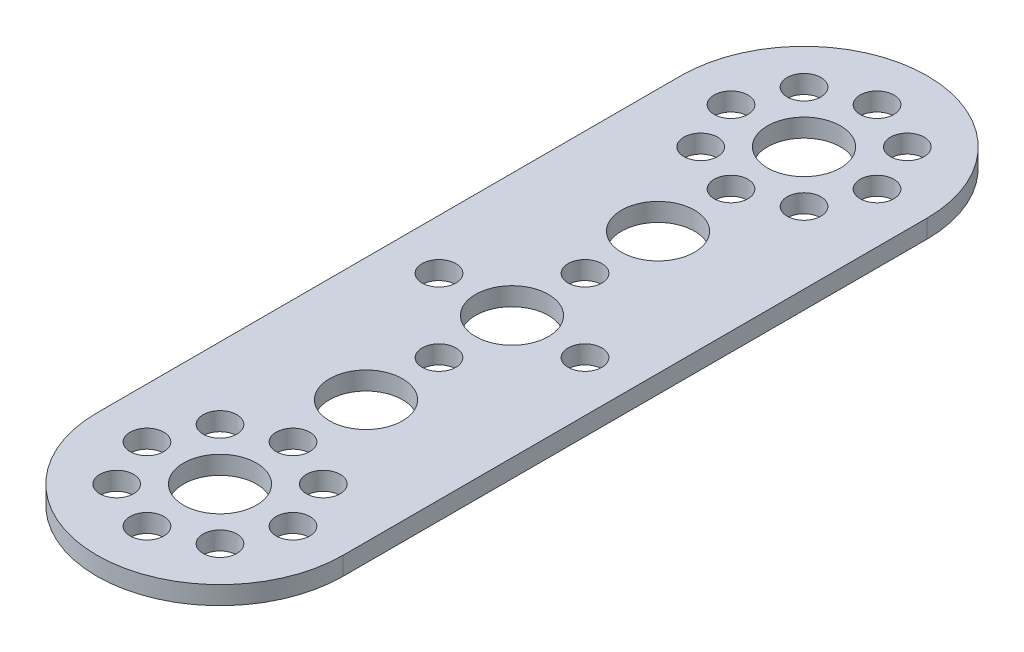
ISO-10303-21;
HEADER;
FILE_DESCRIPTION(('STEP AP214'),'2;1');
FILE_NAME('part.step','',(''),(''),'','','');
FILE_SCHEMA(('AUTOMOTIVE_DESIGN { 1 0 10303 214 1 1 1 1 }'));
ENDSEC;
DATA;
#1=APPLICATION_CONTEXT('core data for automotive mechanical design processes');
#2=APPLICATION_PROTOCOL_DEFINITION('international standard','automotive_design',2000,#1);
#3=PRODUCT_CONTEXT('',#1,'mechanical');
#4=PRODUCT('Part','Part','',(#3));
#5=PRODUCT_RELATED_PRODUCT_CATEGORY('part','',(#4));
#6=PRODUCT_DEFINITION_FORMATION('','',#4);
#7=PRODUCT_DEFINITION_CONTEXT('part definition',#1,'design');
#8=PRODUCT_DEFINITION('design','',#6,#7);
#9=PRODUCT_DEFINITION_SHAPE('','',#8);
#10=(LENGTH_UNIT() NAMED_UNIT(*) SI_UNIT(.MILLI.,.METRE.));
#11=(NAMED_UNIT(*) PLANE_ANGLE_UNIT() SI_UNIT($,.RADIAN.));
#12=(NAMED_UNIT(*) SI_UNIT($,.STERADIAN.) SOLID_ANGLE_UNIT());
#13=UNCERTAINTY_MEASURE_WITH_UNIT(LENGTH_MEASURE(1.E-05),#10,'distance_accuracy_value','');
#14=(GEOMETRIC_REPRESENTATION_CONTEXT(3) GLOBAL_UNCERTAINTY_ASSIGNED_CONTEXT((#13)) GLOBAL_UNIT_ASSIGNED_CONTEXT((#10,
#11,#12)) REPRESENTATION_CONTEXT('',''));
#15=CARTESIAN_POINT('',(0.,0.,0.));
#16=DIRECTION('',(0.,0.,1.));
#17=DIRECTION('',(1.,0.,0.));
#18=AXIS2_PLACEMENT_3D('',#15,#16,#17);
#19=CARTESIAN_POINT('',(0.,2.,-32.));
#20=DIRECTION('',(0.,-1.,0.));
#21=DIRECTION('',(0.,0.,-1.));
#22=AXIS2_PLACEMENT_3D('',#19,#20,#21);
#23=CYLINDRICAL_SURFACE('',#22,13.5);
#24=CARTESIAN_POINT('',(0.,0.,-32.));
#25=DIRECTION('',(0.,1.,0.));
#26=DIRECTION('',(0.,0.,1.));
#27=AXIS2_PLACEMENT_3D('',#24,#25,#26);
#28=CIRCLE('',#27,13.5);
#29=CARTESIAN_POINT('',(13.5,0.,-32.));
#30=VERTEX_POINT('',#29);
#31=CARTESIAN_POINT('',(-13.5,0.,-32.));
#32=VERTEX_POINT('',#31);
#33=EDGE_CURVE('E95',#30,#32,#28,.T.);
#34=ORIENTED_EDGE('',*,*,#33,.T.);
#35=DIRECTION('',(0.,-1.,0.));
#36=VECTOR('',#35,1.);
#37=CARTESIAN_POINT('',(-13.5,2.,-32.));
#38=LINE('',#37,#36);
#39=CARTESIAN_POINT('',(-13.5,2.,-32.));
#40=VERTEX_POINT('',#39);
#41=EDGE_CURVE('E11',#40,#32,#38,.T.);
#42=ORIENTED_EDGE('',*,*,#41,.F.);
#43=CARTESIAN_POINT('',(0.,2.,-32.));
#44=DIRECTION('',(0.,1.,0.));
#45=DIRECTION('',(0.,0.,1.));
#46=AXIS2_PLACEMENT_3D('',#43,#44,#45);
#47=CIRCLE('',#46,13.5);
#48=CARTESIAN_POINT('',(13.5,2.,-32.));
#49=VERTEX_POINT('',#48);
#50=EDGE_CURVE('E83',#49,#40,#47,.T.);
#51=ORIENTED_EDGE('',*,*,#50,.F.);
#52=DIRECTION('',(0.,-1.,0.));
#53=VECTOR('',#52,1.);
#54=CARTESIAN_POINT('',(13.5,2.,-32.));
#55=LINE('',#54,#53);
#56=EDGE_CURVE('E91',#49,#30,#55,.T.);
#57=ORIENTED_EDGE('',*,*,#56,.T.);
#58=EDGE_LOOP('',(#34,#42,#51,#57));
#59=FACE_BOUND('',#58,.T.);
#60=ADVANCED_FACE('F32',(#59),#23,.T.);
#61=CARTESIAN_POINT('',(-13.5,2.,32.));
#62=DIRECTION('',(1.,0.,0.));
#63=DIRECTION('',(0.,0.,-1.));
#64=AXIS2_PLACEMENT_3D('',#61,#62,#63);
#65=PLANE('',#64);
#66=DIRECTION('',(0.,0.,1.));
#67=VECTOR('',#66,1.);
#68=CARTESIAN_POINT('',(-13.5,0.,32.));
#69=LINE('',#68,#67);
#70=CARTESIAN_POINT('',(-13.5,0.,32.));
#71=VERTEX_POINT('',#70);
#72=EDGE_CURVE('E87',#32,#71,#69,.T.);
#73=ORIENTED_EDGE('',*,*,#72,.T.);
#74=DIRECTION('',(0.,-1.,0.));
#75=VECTOR('',#74,1.);
#76=CARTESIAN_POINT('',(-13.5,2.,32.));
#77=LINE('',#76,#75);
#78=CARTESIAN_POINT('',(-13.5,2.,32.));
#79=VERTEX_POINT('',#78);
#80=EDGE_CURVE('E40',#79,#71,#77,.T.);
#81=ORIENTED_EDGE('',*,*,#80,.F.);
#82=DIRECTION('',(0.,0.,1.));
#83=VECTOR('',#82,1.);
#84=CARTESIAN_POINT('',(-13.5,2.,32.));
#85=LINE('',#84,#83);
#86=EDGE_CURVE('E78',#40,#79,#85,.T.);
#87=ORIENTED_EDGE('',*,*,#86,.F.);
#88=ORIENTED_EDGE('',*,*,#41,.T.);
#89=EDGE_LOOP('',(#73,#81,#87,#88));
#90=FACE_BOUND('',#89,.T.);
#91=ADVANCED_FACE('F86',(#90),#65,.F.);
#92=CARTESIAN_POINT('',(0.,2.,32.));
#93=DIRECTION('',(0.,-1.,0.));
#94=DIRECTION('',(0.,0.,-1.));
#95=AXIS2_PLACEMENT_3D('',#92,#93,#94);
#96=CYLINDRICAL_SURFACE('',#95,13.5);
#97=CARTESIAN_POINT('',(0.,0.,32.));
#98=DIRECTION('',(0.,1.,0.));
#99=DIRECTION('',(0.,0.,1.));
#100=AXIS2_PLACEMENT_3D('',#97,#98,#99);
#101=CIRCLE('',#100,13.5);
#102=CARTESIAN_POINT('',(13.5,0.,32.));
#103=VERTEX_POINT('',#102);
#104=EDGE_CURVE('E65',#71,#103,#101,.T.);
#105=ORIENTED_EDGE('',*,*,#104,.T.);
#106=DIRECTION('',(0.,-1.,0.));
#107=VECTOR('',#106,1.);
#108=CARTESIAN_POINT('',(13.5,2.,32.));
#109=LINE('',#108,#107);
#110=CARTESIAN_POINT('',(13.5,2.,32.));
#111=VERTEX_POINT('',#110);
#112=EDGE_CURVE('E88',#111,#103,#109,.T.);
#113=ORIENTED_EDGE('',*,*,#112,.F.);
#114=CARTESIAN_POINT('',(0.,2.,32.));
#115=DIRECTION('',(0.,1.,0.));
#116=DIRECTION('',(0.,0.,1.));
#117=AXIS2_PLACEMENT_3D('',#114,#115,#116);
#118=CIRCLE('',#117,13.5);
#119=EDGE_CURVE('E81',#79,#111,#118,.T.);
#120=ORIENTED_EDGE('',*,*,#119,.F.);
#121=ORIENTED_EDGE('',*,*,#80,.T.);
#122=EDGE_LOOP('',(#105,#113,#120,#121));
#123=FACE_BOUND('',#122,.T.);
#124=ADVANCED_FACE('F89',(#123),#96,.T.);
#125=CARTESIAN_POINT('',(13.5,2.,32.));
#126=DIRECTION('',(-1.,0.,0.));
#127=DIRECTION('',(0.,0.,1.));
#128=AXIS2_PLACEMENT_3D('',#125,#126,#127);
#129=PLANE('',#128);
#130=DIRECTION('',(0.,0.,-1.));
#131=VECTOR('',#130,1.);
#132=CARTESIAN_POINT('',(13.5,0.,32.));
#133=LINE('',#132,#131);
#134=EDGE_CURVE('E71',#103,#30,#133,.T.);
#135=ORIENTED_EDGE('',*,*,#134,.T.);
#136=ORIENTED_EDGE('',*,*,#56,.F.);
#137=DIRECTION('',(0.,0.,-1.));
#138=VECTOR('',#137,1.);
#139=CARTESIAN_POINT('',(13.5,2.,32.));
#140=LINE('',#139,#138);
#141=EDGE_CURVE('E48',#111,#49,#140,.T.);
#142=ORIENTED_EDGE('',*,*,#141,.F.);
#143=ORIENTED_EDGE('',*,*,#112,.T.);
#144=EDGE_LOOP('',(#135,#136,#142,#143));
#145=FACE_BOUND('',#144,.T.);
#146=ADVANCED_FACE('F103',(#145),#129,.F.);
#147=CARTESIAN_POINT('',(0.,2.,-32.));
#148=DIRECTION('',(0.,1.,0.));
#149=DIRECTION('',(0.,0.,1.));
#150=AXIS2_PLACEMENT_3D('',#147,#148,#149);
#151=PLANE('',#150);
#152=CARTESIAN_POINT('',(5.65999999999991,2.,-26.34));
#153=DIRECTION('',(0.,1.,0.));
#154=DIRECTION('',(0.,0.,1.));
#155=AXIS2_PLACEMENT_3D('',#152,#153,#154);
#156=CIRCLE('',#155,1.84999999999998);
#157=CARTESIAN_POINT('',(5.65999999999991,2.,-24.49));
#158=VERTEX_POINT('',#157);
#159=EDGE_CURVE('E253',#158,#158,#156,.T.);
#160=ORIENTED_EDGE('',*,*,#159,.F.);
#161=EDGE_LOOP('',(#160));
#162=FACE_BOUND('',#161,.T.);
#163=CARTESIAN_POINT('',(5.65999999999987,2.,-37.66));
#164=DIRECTION('',(0.,1.,0.));
#165=DIRECTION('',(0.,0.,1.));
#166=AXIS2_PLACEMENT_3D('',#163,#164,#165);
#167=CIRCLE('',#166,1.84999999999997);
#168=CARTESIAN_POINT('',(5.65999999999987,2.,-35.8100000000001));
#169=VERTEX_POINT('',#168);
#170=EDGE_CURVE('E247',#169,#169,#167,.T.);
#171=ORIENTED_EDGE('',*,*,#170,.F.);
#172=EDGE_LOOP('',(#171));
#173=FACE_BOUND('',#172,.T.);
#174=CARTESIAN_POINT('',(-5.66000000000013,2.,-37.66));
#175=DIRECTION('',(0.,1.,0.));
#176=DIRECTION('',(0.,0.,1.));
#177=AXIS2_PLACEMENT_3D('',#174,#175,#176);
#178=CIRCLE('',#177,1.84999999999998);
#179=CARTESIAN_POINT('',(-5.66000000000013,2.,-35.81));
#180=VERTEX_POINT('',#179);
#181=EDGE_CURVE('E241',#180,#180,#178,.T.);
#182=ORIENTED_EDGE('',*,*,#181,.F.);
#183=EDGE_LOOP('',(#182));
#184=FACE_BOUND('',#183,.T.);
#185=CARTESIAN_POINT('',(-5.66000000000009,2.,-26.34));
#186=DIRECTION('',(0.,1.,0.));
#187=DIRECTION('',(0.,0.,1.));
#188=AXIS2_PLACEMENT_3D('',#185,#186,#187);
#189=CIRCLE('',#188,1.84999999999998);
#190=CARTESIAN_POINT('',(-5.66000000000009,2.,-24.49));
#191=VERTEX_POINT('',#190);
#192=EDGE_CURVE('E235',#191,#191,#189,.T.);
#193=ORIENTED_EDGE('',*,*,#192,.F.);
#194=EDGE_LOOP('',(#193));
#195=FACE_BOUND('',#194,.T.);
#196=CARTESIAN_POINT('',(-8.00000000000011,2.,-32.));
#197=DIRECTION('',(0.,1.,0.));
#198=DIRECTION('',(0.,0.,1.));
#199=AXIS2_PLACEMENT_3D('',#196,#197,#198);
#200=CIRCLE('',#199,1.84999999999998);
#201=CARTESIAN_POINT('',(-8.00000000000011,2.,-30.15));
#202=VERTEX_POINT('',#201);
#203=EDGE_CURVE('E229',#202,#202,#200,.T.);
#204=ORIENTED_EDGE('',*,*,#203,.F.);
#205=EDGE_LOOP('',(#204));
#206=FACE_BOUND('',#205,.T.);
#207=CARTESIAN_POINT('',(7.99999999999989,2.,-32.));
#208=DIRECTION('',(0.,1.,0.));
#209=DIRECTION('',(0.,0.,1.));
#210=AXIS2_PLACEMENT_3D('',#207,#208,#209);
#211=CIRCLE('',#210,1.84999999999998);
#212=CARTESIAN_POINT('',(7.99999999999989,2.,-30.15));
#213=VERTEX_POINT('',#212);
#214=EDGE_CURVE('E223',#213,#213,#211,.T.);
#215=ORIENTED_EDGE('',*,*,#214,.F.);
#216=EDGE_LOOP('',(#215));
#217=FACE_BOUND('',#216,.T.);
#218=CARTESIAN_POINT('',(0.,2.,-24.));
#219=DIRECTION('',(0.,1.,0.));
#220=DIRECTION('',(0.,0.,1.));
#221=AXIS2_PLACEMENT_3D('',#218,#219,#220);
#222=CIRCLE('',#221,1.85000000000001);
#223=CARTESIAN_POINT('',(0.,2.,-22.15));
#224=VERTEX_POINT('',#223);
#225=EDGE_CURVE('E217',#224,#224,#222,.T.);
#226=ORIENTED_EDGE('',*,*,#225,.F.);
#227=EDGE_LOOP('',(#226));
#228=FACE_BOUND('',#227,.T.);
#229=CARTESIAN_POINT('',(-1.39306751897883E-13,2.,-40.));
#230=DIRECTION('',(0.,1.,0.));
#231=DIRECTION('',(0.,0.,1.));
#232=AXIS2_PLACEMENT_3D('',#229,#230,#231);
#233=CIRCLE('',#232,1.84999999999998);
#234=CARTESIAN_POINT('',(-1.39306751897883E-13,2.,-38.15));
#235=VERTEX_POINT('',#234);
#236=EDGE_CURVE('E211',#235,#235,#233,.T.);
#237=ORIENTED_EDGE('',*,*,#236,.F.);
#238=EDGE_LOOP('',(#237));
#239=FACE_BOUND('',#238,.T.);
#240=CARTESIAN_POINT('',(-1.11374885009008E-13,2.,-32.));
#241=DIRECTION('',(0.,1.,0.));
#242=DIRECTION('',(0.,0.,1.));
#243=AXIS2_PLACEMENT_3D('',#240,#241,#242);
#244=CIRCLE('',#243,4.);
#245=CARTESIAN_POINT('',(-1.11374885009008E-13,2.,-28.));
#246=VERTEX_POINT('',#245);
#247=EDGE_CURVE('E205',#246,#246,#244,.T.);
#248=ORIENTED_EDGE('',*,*,#247,.F.);
#249=EDGE_LOOP('',(#248));
#250=FACE_BOUND('',#249,.T.);
#251=CARTESIAN_POINT('',(5.66000000000013,2.,37.66));
#252=DIRECTION('',(0.,1.,0.));
#253=DIRECTION('',(0.,0.,1.));
#254=AXIS2_PLACEMENT_3D('',#251,#252,#253);
#255=CIRCLE('',#254,1.84999999999998);
#256=CARTESIAN_POINT('',(5.66000000000013,2.,39.51));
#257=VERTEX_POINT('',#256);
#258=EDGE_CURVE('E199',#257,#257,#255,.T.);
#259=ORIENTED_EDGE('',*,*,#258,.F.);
#260=EDGE_LOOP('',(#259));
#261=FACE_BOUND('',#260,.T.);
#262=CARTESIAN_POINT('',(5.66000000000009,2.,26.34));
#263=DIRECTION('',(0.,1.,0.));
#264=DIRECTION('',(0.,0.,1.));
#265=AXIS2_PLACEMENT_3D('',#262,#263,#264);
#266=CIRCLE('',#265,1.84999999999998);
#267=CARTESIAN_POINT('',(5.66000000000009,2.,28.19));
#268=VERTEX_POINT('',#267);
#269=EDGE_CURVE('E193',#268,#268,#266,.T.);
#270=ORIENTED_EDGE('',*,*,#269,.F.);
#271=EDGE_LOOP('',(#270));
#272=FACE_BOUND('',#271,.T.);
#273=CARTESIAN_POINT('',(-5.65999999999991,2.,26.34));
#274=DIRECTION('',(0.,1.,0.));
#275=DIRECTION('',(0.,0.,1.));
#276=AXIS2_PLACEMENT_3D('',#273,#274,#275);
#277=CIRCLE('',#276,1.84999999999998);
#278=CARTESIAN_POINT('',(-5.65999999999991,2.,28.19));
#279=VERTEX_POINT('',#278);
#280=EDGE_CURVE('E187',#279,#279,#277,.T.);
#281=ORIENTED_EDGE('',*,*,#280,.F.);
#282=EDGE_LOOP('',(#281));
#283=FACE_BOUND('',#282,.T.);
#284=CARTESIAN_POINT('',(-5.65999999999987,2.,37.66));
#285=DIRECTION('',(0.,1.,0.));
#286=DIRECTION('',(0.,0.,1.));
#287=AXIS2_PLACEMENT_3D('',#284,#285,#286);
#288=CIRCLE('',#287,1.84999999999998);
#289=CARTESIAN_POINT('',(-5.65999999999987,2.,39.51));
#290=VERTEX_POINT('',#289);
#291=EDGE_CURVE('E181',#290,#290,#288,.T.);
#292=ORIENTED_EDGE('',*,*,#291,.F.);
#293=EDGE_LOOP('',(#292));
#294=FACE_BOUND('',#293,.T.);
#295=CARTESIAN_POINT('',(-7.99999999999989,2.,32.));
#296=DIRECTION('',(0.,1.,0.));
#297=DIRECTION('',(0.,0.,1.));
#298=AXIS2_PLACEMENT_3D('',#295,#296,#297);
#299=CIRCLE('',#298,1.84999999999998);
#300=CARTESIAN_POINT('',(-7.99999999999989,2.,33.85));
#301=VERTEX_POINT('',#300);
#302=EDGE_CURVE('E175',#301,#301,#299,.T.);
#303=ORIENTED_EDGE('',*,*,#302,.F.);
#304=EDGE_LOOP('',(#303));
#305=FACE_BOUND('',#304,.T.);
#306=CARTESIAN_POINT('',(8.00000000000011,2.,32.));
#307=DIRECTION('',(0.,1.,0.));
#308=DIRECTION('',(0.,0.,1.));
#309=AXIS2_PLACEMENT_3D('',#306,#307,#308);
#310=CIRCLE('',#309,1.84999999999998);
#311=CARTESIAN_POINT('',(8.00000000000011,2.,33.85));
#312=VERTEX_POINT('',#311);
#313=EDGE_CURVE('E169',#312,#312,#310,.T.);
#314=ORIENTED_EDGE('',*,*,#313,.F.);
#315=EDGE_LOOP('',(#314));
#316=FACE_BOUND('',#315,.T.);
#317=CARTESIAN_POINT('',(1.40011916990868E-13,2.,40.));
#318=DIRECTION('',(0.,1.,0.));
#319=DIRECTION('',(0.,0.,1.));
#320=AXIS2_PLACEMENT_3D('',#317,#318,#319);
#321=CIRCLE('',#320,1.84999999999998);
#322=CARTESIAN_POINT('',(1.40011916990868E-13,2.,41.85));
#323=VERTEX_POINT('',#322);
#324=EDGE_CURVE('E163',#323,#323,#321,.T.);
#325=ORIENTED_EDGE('',*,*,#324,.F.);
#326=EDGE_LOOP('',(#325));
#327=FACE_BOUND('',#326,.T.);
#328=CARTESIAN_POINT('',(0.,2.,24.));
#329=DIRECTION('',(0.,1.,0.));
#330=DIRECTION('',(0.,0.,1.));
#331=AXIS2_PLACEMENT_3D('',#328,#329,#330);
#332=CIRCLE('',#331,1.84999999999998);
#333=CARTESIAN_POINT('',(0.,2.,25.85));
#334=VERTEX_POINT('',#333);
#335=EDGE_CURVE('E157',#334,#334,#332,.T.);
#336=ORIENTED_EDGE('',*,*,#335,.F.);
#337=EDGE_LOOP('',(#336));
#338=FACE_BOUND('',#337,.T.);
#339=CARTESIAN_POINT('',(1.12080050101992E-13,2.,32.));
#340=DIRECTION('',(0.,1.,0.));
#341=DIRECTION('',(0.,0.,1.));
#342=AXIS2_PLACEMENT_3D('',#339,#340,#341);
#343=CIRCLE('',#342,3.99999999999999);
#344=CARTESIAN_POINT('',(1.12080050101992E-13,2.,36.));
#345=VERTEX_POINT('',#344);
#346=EDGE_CURVE('E151',#345,#345,#343,.T.);
#347=ORIENTED_EDGE('',*,*,#346,.F.);
#348=EDGE_LOOP('',(#347));
#349=FACE_BOUND('',#348,.T.);
#350=CARTESIAN_POINT('',(-8.,2.,0.));
#351=DIRECTION('',(0.,1.,0.));
#352=DIRECTION('',(0.,0.,1.));
#353=AXIS2_PLACEMENT_3D('',#350,#351,#352);
#354=CIRCLE('',#353,1.85);
#355=CARTESIAN_POINT('',(-8.,2.,1.85000000000003));
#356=VERTEX_POINT('',#355);
#357=EDGE_CURVE('E145',#356,#356,#354,.T.);
#358=ORIENTED_EDGE('',*,*,#357,.F.);
#359=EDGE_LOOP('',(#358));
#360=FACE_BOUND('',#359,.T.);
#361=CARTESIAN_POINT('',(8.,2.,0.));
#362=DIRECTION('',(0.,1.,0.));
#363=DIRECTION('',(0.,0.,1.));
#364=AXIS2_PLACEMENT_3D('',#361,#362,#363);
#365=CIRCLE('',#364,1.85);
#366=CARTESIAN_POINT('',(8.,2.,1.84999999999998));
#367=VERTEX_POINT('',#366);
#368=EDGE_CURVE('E139',#367,#367,#365,.T.);
#369=ORIENTED_EDGE('',*,*,#368,.F.);
#370=EDGE_LOOP('',(#369));
#371=FACE_BOUND('',#370,.T.);
#372=CARTESIAN_POINT('',(0.,2.,8.00000000000001));
#373=DIRECTION('',(0.,1.,0.));
#374=DIRECTION('',(0.,0.,1.));
#375=AXIS2_PLACEMENT_3D('',#372,#373,#374);
#376=CIRCLE('',#375,1.85);
#377=CARTESIAN_POINT('',(0.,2.,9.85000000000001));
#378=VERTEX_POINT('',#377);
#379=EDGE_CURVE('E133',#378,#378,#376,.T.);
#380=ORIENTED_EDGE('',*,*,#379,.F.);
#381=EDGE_LOOP('',(#380));
#382=FACE_BOUND('',#381,.T.);
#383=CARTESIAN_POINT('',(0.,2.,-8.00000000000001));
#384=DIRECTION('',(0.,1.,0.));
#385=DIRECTION('',(0.,0.,1.));
#386=AXIS2_PLACEMENT_3D('',#383,#384,#385);
#387=CIRCLE('',#386,1.85);
#388=CARTESIAN_POINT('',(0.,2.,-6.15));
#389=VERTEX_POINT('',#388);
#390=EDGE_CURVE('E127',#389,#389,#387,.T.);
#391=ORIENTED_EDGE('',*,*,#390,.F.);
#392=EDGE_LOOP('',(#391));
#393=FACE_BOUND('',#392,.T.);
#394=CARTESIAN_POINT('',(0.,2.,0.));
#395=DIRECTION('',(0.,1.,0.));
#396=DIRECTION('',(0.,0.,1.));
#397=AXIS2_PLACEMENT_3D('',#394,#395,#396);
#398=CIRCLE('',#397,4.00000000000002);
#399=CARTESIAN_POINT('',(0.,2.,4.00000000000002));
#400=VERTEX_POINT('',#399);
#401=EDGE_CURVE('E121',#400,#400,#398,.T.);
#402=ORIENTED_EDGE('',*,*,#401,.F.);
#403=EDGE_LOOP('',(#402));
#404=FACE_BOUND('',#403,.T.);
#405=CARTESIAN_POINT('',(0.,2.,-16.));
#406=DIRECTION('',(0.,1.,0.));
#407=DIRECTION('',(0.,0.,1.));
#408=AXIS2_PLACEMENT_3D('',#405,#406,#407);
#409=CIRCLE('',#408,4.00000000000002);
#410=CARTESIAN_POINT('',(0.,2.,-12.));
#411=VERTEX_POINT('',#410);
#412=EDGE_CURVE('E115',#411,#411,#409,.T.);
#413=ORIENTED_EDGE('',*,*,#412,.F.);
#414=EDGE_LOOP('',(#413));
#415=FACE_BOUND('',#414,.T.);
#416=CARTESIAN_POINT('',(0.,2.,16.));
#417=DIRECTION('',(0.,1.,0.));
#418=DIRECTION('',(0.,0.,1.));
#419=AXIS2_PLACEMENT_3D('',#416,#417,#418);
#420=CIRCLE('',#419,3.99999999999999);
#421=CARTESIAN_POINT('',(0.,2.,20.));
#422=VERTEX_POINT('',#421);
#423=EDGE_CURVE('E109',#422,#422,#420,.T.);
#424=ORIENTED_EDGE('',*,*,#423,.F.);
#425=EDGE_LOOP('',(#424));
#426=FACE_BOUND('',#425,.T.);
#427=ORIENTED_EDGE('',*,*,#50,.T.);
#428=ORIENTED_EDGE('',*,*,#86,.T.);
#429=ORIENTED_EDGE('',*,*,#119,.T.);
#430=ORIENTED_EDGE('',*,*,#141,.T.);
#431=EDGE_LOOP('',(#427,#428,#429,#430));
#432=FACE_BOUND('',#431,.T.);
#433=ADVANCED_FACE('F79',(#162,#173,#184,#195,#206,#217,#228,#239,#250,#261,#272,#283,#294,#305,
#316,#327,#338,#349,#360,#371,#382,#393,#404,#415,#426,#432),#151,.T.);
#434=CARTESIAN_POINT('',(0.,0.,-32.));
#435=DIRECTION('',(0.,1.,0.));
#436=DIRECTION('',(0.,0.,1.));
#437=AXIS2_PLACEMENT_3D('',#434,#435,#436);
#438=PLANE('',#437);
#439=CARTESIAN_POINT('',(5.65999999999991,0.,-26.34));
#440=DIRECTION('',(0.,1.,0.));
#441=DIRECTION('',(0.,0.,1.));
#442=AXIS2_PLACEMENT_3D('',#439,#440,#441);
#443=CIRCLE('',#442,1.84999999999998);
#444=CARTESIAN_POINT('',(5.65999999999991,0.,-24.49));
#445=VERTEX_POINT('',#444);
#446=EDGE_CURVE('E250',#445,#445,#443,.T.);
#447=ORIENTED_EDGE('',*,*,#446,.T.);
#448=EDGE_LOOP('',(#447));
#449=FACE_BOUND('',#448,.T.);
#450=CARTESIAN_POINT('',(5.65999999999987,0.,-37.66));
#451=DIRECTION('',(0.,1.,0.));
#452=DIRECTION('',(0.,0.,1.));
#453=AXIS2_PLACEMENT_3D('',#450,#451,#452);
#454=CIRCLE('',#453,1.84999999999997);
#455=CARTESIAN_POINT('',(5.65999999999987,0.,-35.8100000000001));
#456=VERTEX_POINT('',#455);
#457=EDGE_CURVE('E244',#456,#456,#454,.T.);
#458=ORIENTED_EDGE('',*,*,#457,.T.);
#459=EDGE_LOOP('',(#458));
#460=FACE_BOUND('',#459,.T.);
#461=CARTESIAN_POINT('',(-5.66000000000013,0.,-37.66));
#462=DIRECTION('',(0.,1.,0.));
#463=DIRECTION('',(0.,0.,1.));
#464=AXIS2_PLACEMENT_3D('',#461,#462,#463);
#465=CIRCLE('',#464,1.84999999999998);
#466=CARTESIAN_POINT('',(-5.66000000000013,0.,-35.81));
#467=VERTEX_POINT('',#466);
#468=EDGE_CURVE('E238',#467,#467,#465,.T.);
#469=ORIENTED_EDGE('',*,*,#468,.T.);
#470=EDGE_LOOP('',(#469));
#471=FACE_BOUND('',#470,.T.);
#472=CARTESIAN_POINT('',(-5.66000000000009,0.,-26.34));
#473=DIRECTION('',(0.,1.,0.));
#474=DIRECTION('',(0.,0.,1.));
#475=AXIS2_PLACEMENT_3D('',#472,#473,#474);
#476=CIRCLE('',#475,1.84999999999998);
#477=CARTESIAN_POINT('',(-5.66000000000009,0.,-24.49));
#478=VERTEX_POINT('',#477);
#479=EDGE_CURVE('E232',#478,#478,#476,.T.);
#480=ORIENTED_EDGE('',*,*,#479,.T.);
#481=EDGE_LOOP('',(#480));
#482=FACE_BOUND('',#481,.T.);
#483=CARTESIAN_POINT('',(-8.00000000000011,0.,-32.));
#484=DIRECTION('',(0.,1.,0.));
#485=DIRECTION('',(0.,0.,1.));
#486=AXIS2_PLACEMENT_3D('',#483,#484,#485);
#487=CIRCLE('',#486,1.84999999999998);
#488=CARTESIAN_POINT('',(-8.00000000000011,0.,-30.15));
#489=VERTEX_POINT('',#488);
#490=EDGE_CURVE('E226',#489,#489,#487,.T.);
#491=ORIENTED_EDGE('',*,*,#490,.T.);
#492=EDGE_LOOP('',(#491));
#493=FACE_BOUND('',#492,.T.);
#494=CARTESIAN_POINT('',(7.99999999999989,0.,-32.));
#495=DIRECTION('',(0.,1.,0.));
#496=DIRECTION('',(0.,0.,1.));
#497=AXIS2_PLACEMENT_3D('',#494,#495,#496);
#498=CIRCLE('',#497,1.84999999999998);
#499=CARTESIAN_POINT('',(7.99999999999989,0.,-30.15));
#500=VERTEX_POINT('',#499);
#501=EDGE_CURVE('E220',#500,#500,#498,.T.);
#502=ORIENTED_EDGE('',*,*,#501,.T.);
#503=EDGE_LOOP('',(#502));
#504=FACE_BOUND('',#503,.T.);
#505=CARTESIAN_POINT('',(0.,0.,-24.));
#506=DIRECTION('',(0.,1.,0.));
#507=DIRECTION('',(0.,0.,1.));
#508=AXIS2_PLACEMENT_3D('',#505,#506,#507);
#509=CIRCLE('',#508,1.85000000000001);
#510=CARTESIAN_POINT('',(0.,0.,-22.15));
#511=VERTEX_POINT('',#510);
#512=EDGE_CURVE('E214',#511,#511,#509,.T.);
#513=ORIENTED_EDGE('',*,*,#512,.T.);
#514=EDGE_LOOP('',(#513));
#515=FACE_BOUND('',#514,.T.);
#516=CARTESIAN_POINT('',(-1.39306751897883E-13,0.,-40.));
#517=DIRECTION('',(0.,1.,0.));
#518=DIRECTION('',(0.,0.,1.));
#519=AXIS2_PLACEMENT_3D('',#516,#517,#518);
#520=CIRCLE('',#519,1.84999999999998);
#521=CARTESIAN_POINT('',(-1.39306751897883E-13,0.,-38.15));
#522=VERTEX_POINT('',#521);
#523=EDGE_CURVE('E208',#522,#522,#520,.T.);
#524=ORIENTED_EDGE('',*,*,#523,.T.);
#525=EDGE_LOOP('',(#524));
#526=FACE_BOUND('',#525,.T.);
#527=CARTESIAN_POINT('',(-1.11374885009008E-13,0.,-32.));
#528=DIRECTION('',(0.,1.,0.));
#529=DIRECTION('',(0.,0.,1.));
#530=AXIS2_PLACEMENT_3D('',#527,#528,#529);
#531=CIRCLE('',#530,4.);
#532=CARTESIAN_POINT('',(-1.11374885009008E-13,0.,-28.));
#533=VERTEX_POINT('',#532);
#534=EDGE_CURVE('E202',#533,#533,#531,.T.);
#535=ORIENTED_EDGE('',*,*,#534,.T.);
#536=EDGE_LOOP('',(#535));
#537=FACE_BOUND('',#536,.T.);
#538=CARTESIAN_POINT('',(5.66000000000013,0.,37.66));
#539=DIRECTION('',(0.,1.,0.));
#540=DIRECTION('',(0.,0.,1.));
#541=AXIS2_PLACEMENT_3D('',#538,#539,#540);
#542=CIRCLE('',#541,1.84999999999998);
#543=CARTESIAN_POINT('',(5.66000000000013,0.,39.51));
#544=VERTEX_POINT('',#543);
#545=EDGE_CURVE('E196',#544,#544,#542,.T.);
#546=ORIENTED_EDGE('',*,*,#545,.T.);
#547=EDGE_LOOP('',(#546));
#548=FACE_BOUND('',#547,.T.);
#549=CARTESIAN_POINT('',(5.66000000000009,0.,26.34));
#550=DIRECTION('',(0.,1.,0.));
#551=DIRECTION('',(0.,0.,1.));
#552=AXIS2_PLACEMENT_3D('',#549,#550,#551);
#553=CIRCLE('',#552,1.84999999999998);
#554=CARTESIAN_POINT('',(5.66000000000009,0.,28.19));
#555=VERTEX_POINT('',#554);
#556=EDGE_CURVE('E190',#555,#555,#553,.T.);
#557=ORIENTED_EDGE('',*,*,#556,.T.);
#558=EDGE_LOOP('',(#557));
#559=FACE_BOUND('',#558,.T.);
#560=CARTESIAN_POINT('',(-5.65999999999991,0.,26.34));
#561=DIRECTION('',(0.,1.,0.));
#562=DIRECTION('',(0.,0.,1.));
#563=AXIS2_PLACEMENT_3D('',#560,#561,#562);
#564=CIRCLE('',#563,1.84999999999998);
#565=CARTESIAN_POINT('',(-5.65999999999991,0.,28.19));
#566=VERTEX_POINT('',#565);
#567=EDGE_CURVE('E184',#566,#566,#564,.T.);
#568=ORIENTED_EDGE('',*,*,#567,.T.);
#569=EDGE_LOOP('',(#568));
#570=FACE_BOUND('',#569,.T.);
#571=CARTESIAN_POINT('',(-5.65999999999987,0.,37.66));
#572=DIRECTION('',(0.,1.,0.));
#573=DIRECTION('',(0.,0.,1.));
#574=AXIS2_PLACEMENT_3D('',#571,#572,#573);
#575=CIRCLE('',#574,1.84999999999998);
#576=CARTESIAN_POINT('',(-5.65999999999987,0.,39.51));
#577=VERTEX_POINT('',#576);
#578=EDGE_CURVE('E178',#577,#577,#575,.T.);
#579=ORIENTED_EDGE('',*,*,#578,.T.);
#580=EDGE_LOOP('',(#579));
#581=FACE_BOUND('',#580,.T.);
#582=CARTESIAN_POINT('',(-7.99999999999989,0.,32.));
#583=DIRECTION('',(0.,1.,0.));
#584=DIRECTION('',(0.,0.,1.));
#585=AXIS2_PLACEMENT_3D('',#582,#583,#584);
#586=CIRCLE('',#585,1.84999999999998);
#587=CARTESIAN_POINT('',(-7.99999999999989,0.,33.85));
#588=VERTEX_POINT('',#587);
#589=EDGE_CURVE('E172',#588,#588,#586,.T.);
#590=ORIENTED_EDGE('',*,*,#589,.T.);
#591=EDGE_LOOP('',(#590));
#592=FACE_BOUND('',#591,.T.);
#593=CARTESIAN_POINT('',(8.00000000000011,0.,32.));
#594=DIRECTION('',(0.,1.,0.));
#595=DIRECTION('',(0.,0.,1.));
#596=AXIS2_PLACEMENT_3D('',#593,#594,#595);
#597=CIRCLE('',#596,1.84999999999998);
#598=CARTESIAN_POINT('',(8.00000000000011,0.,33.85));
#599=VERTEX_POINT('',#598);
#600=EDGE_CURVE('E166',#599,#599,#597,.T.);
#601=ORIENTED_EDGE('',*,*,#600,.T.);
#602=EDGE_LOOP('',(#601));
#603=FACE_BOUND('',#602,.T.);
#604=CARTESIAN_POINT('',(1.40011916990868E-13,0.,40.));
#605=DIRECTION('',(0.,1.,0.));
#606=DIRECTION('',(0.,0.,1.));
#607=AXIS2_PLACEMENT_3D('',#604,#605,#606);
#608=CIRCLE('',#607,1.84999999999998);
#609=CARTESIAN_POINT('',(1.40011916990868E-13,0.,41.85));
#610=VERTEX_POINT('',#609);
#611=EDGE_CURVE('E160',#610,#610,#608,.T.);
#612=ORIENTED_EDGE('',*,*,#611,.T.);
#613=EDGE_LOOP('',(#612));
#614=FACE_BOUND('',#613,.T.);
#615=CARTESIAN_POINT('',(0.,0.,24.));
#616=DIRECTION('',(0.,1.,0.));
#617=DIRECTION('',(0.,0.,1.));
#618=AXIS2_PLACEMENT_3D('',#615,#616,#617);
#619=CIRCLE('',#618,1.84999999999998);
#620=CARTESIAN_POINT('',(0.,0.,25.85));
#621=VERTEX_POINT('',#620);
#622=EDGE_CURVE('E154',#621,#621,#619,.T.);
#623=ORIENTED_EDGE('',*,*,#622,.T.);
#624=EDGE_LOOP('',(#623));
#625=FACE_BOUND('',#624,.T.);
#626=CARTESIAN_POINT('',(1.12080050101992E-13,0.,32.));
#627=DIRECTION('',(0.,1.,0.));
#628=DIRECTION('',(0.,0.,1.));
#629=AXIS2_PLACEMENT_3D('',#626,#627,#628);
#630=CIRCLE('',#629,3.99999999999999);
#631=CARTESIAN_POINT('',(1.12080050101992E-13,0.,36.));
#632=VERTEX_POINT('',#631);
#633=EDGE_CURVE('E148',#632,#632,#630,.T.);
#634=ORIENTED_EDGE('',*,*,#633,.T.);
#635=EDGE_LOOP('',(#634));
#636=FACE_BOUND('',#635,.T.);
#637=CARTESIAN_POINT('',(-8.,0.,0.));
#638=DIRECTION('',(0.,1.,0.));
#639=DIRECTION('',(0.,0.,1.));
#640=AXIS2_PLACEMENT_3D('',#637,#638,#639);
#641=CIRCLE('',#640,1.85);
#642=CARTESIAN_POINT('',(-8.,0.,1.85000000000003));
#643=VERTEX_POINT('',#642);
#644=EDGE_CURVE('E142',#643,#643,#641,.T.);
#645=ORIENTED_EDGE('',*,*,#644,.T.);
#646=EDGE_LOOP('',(#645));
#647=FACE_BOUND('',#646,.T.);
#648=CARTESIAN_POINT('',(8.,0.,0.));
#649=DIRECTION('',(0.,1.,0.));
#650=DIRECTION('',(0.,0.,1.));
#651=AXIS2_PLACEMENT_3D('',#648,#649,#650);
#652=CIRCLE('',#651,1.85);
#653=CARTESIAN_POINT('',(8.,0.,1.84999999999998));
#654=VERTEX_POINT('',#653);
#655=EDGE_CURVE('E136',#654,#654,#652,.T.);
#656=ORIENTED_EDGE('',*,*,#655,.T.);
#657=EDGE_LOOP('',(#656));
#658=FACE_BOUND('',#657,.T.);
#659=CARTESIAN_POINT('',(0.,0.,8.00000000000001));
#660=DIRECTION('',(0.,1.,0.));
#661=DIRECTION('',(0.,0.,1.));
#662=AXIS2_PLACEMENT_3D('',#659,#660,#661);
#663=CIRCLE('',#662,1.85);
#664=CARTESIAN_POINT('',(0.,0.,9.85000000000001));
#665=VERTEX_POINT('',#664);
#666=EDGE_CURVE('E130',#665,#665,#663,.T.);
#667=ORIENTED_EDGE('',*,*,#666,.T.);
#668=EDGE_LOOP('',(#667));
#669=FACE_BOUND('',#668,.T.);
#670=CARTESIAN_POINT('',(0.,0.,-8.00000000000001));
#671=DIRECTION('',(0.,1.,0.));
#672=DIRECTION('',(0.,0.,1.));
#673=AXIS2_PLACEMENT_3D('',#670,#671,#672);
#674=CIRCLE('',#673,1.85);
#675=CARTESIAN_POINT('',(0.,0.,-6.15));
#676=VERTEX_POINT('',#675);
#677=EDGE_CURVE('E124',#676,#676,#674,.T.);
#678=ORIENTED_EDGE('',*,*,#677,.T.);
#679=EDGE_LOOP('',(#678));
#680=FACE_BOUND('',#679,.T.);
#681=CARTESIAN_POINT('',(0.,0.,0.));
#682=DIRECTION('',(0.,1.,0.));
#683=DIRECTION('',(0.,0.,1.));
#684=AXIS2_PLACEMENT_3D('',#681,#682,#683);
#685=CIRCLE('',#684,4.00000000000002);
#686=CARTESIAN_POINT('',(0.,0.,4.00000000000002));
#687=VERTEX_POINT('',#686);
#688=EDGE_CURVE('E118',#687,#687,#685,.T.);
#689=ORIENTED_EDGE('',*,*,#688,.T.);
#690=EDGE_LOOP('',(#689));
#691=FACE_BOUND('',#690,.T.);
#692=CARTESIAN_POINT('',(0.,0.,-16.));
#693=DIRECTION('',(0.,1.,0.));
#694=DIRECTION('',(0.,0.,1.));
#695=AXIS2_PLACEMENT_3D('',#692,#693,#694);
#696=CIRCLE('',#695,4.00000000000002);
#697=CARTESIAN_POINT('',(0.,0.,-12.));
#698=VERTEX_POINT('',#697);
#699=EDGE_CURVE('E112',#698,#698,#696,.T.);
#700=ORIENTED_EDGE('',*,*,#699,.T.);
#701=EDGE_LOOP('',(#700));
#702=FACE_BOUND('',#701,.T.);
#703=CARTESIAN_POINT('',(0.,0.,16.));
#704=DIRECTION('',(0.,1.,0.));
#705=DIRECTION('',(0.,0.,1.));
#706=AXIS2_PLACEMENT_3D('',#703,#704,#705);
#707=CIRCLE('',#706,3.99999999999999);
#708=CARTESIAN_POINT('',(0.,0.,20.));
#709=VERTEX_POINT('',#708);
#710=EDGE_CURVE('E98',#709,#709,#707,.T.);
#711=ORIENTED_EDGE('',*,*,#710,.T.);
#712=EDGE_LOOP('',(#711));
#713=FACE_BOUND('',#712,.T.);
#714=ORIENTED_EDGE('',*,*,#33,.F.);
#715=ORIENTED_EDGE('',*,*,#134,.F.);
#716=ORIENTED_EDGE('',*,*,#104,.F.);
#717=ORIENTED_EDGE('',*,*,#72,.F.);
#718=EDGE_LOOP('',(#714,#715,#716,#717));
#719=FACE_BOUND('',#718,.T.);
#720=ADVANCED_FACE('F106',(#449,#460,#471,#482,#493,#504,#515,#526,#537,#548,#559,#570,#581,
#592,#603,#614,#625,#636,#647,#658,#669,#680,#691,#702,#713,#719),#438,.F.);
#721=CARTESIAN_POINT('',(0.,0.,16.));
#722=DIRECTION('',(0.,1.,0.));
#723=DIRECTION('',(0.,0.,1.));
#724=AXIS2_PLACEMENT_3D('',#721,#722,#723);
#725=CYLINDRICAL_SURFACE('',#724,3.99999999999999);
#726=ORIENTED_EDGE('',*,*,#710,.F.);
#727=EDGE_LOOP('',(#726));
#728=FACE_BOUND('',#727,.T.);
#729=ORIENTED_EDGE('',*,*,#423,.T.);
#730=EDGE_LOOP('',(#729));
#731=FACE_BOUND('',#730,.T.);
#732=ADVANCED_FACE('F319',(#728,#731),#725,.F.);
#733=CARTESIAN_POINT('',(0.,0.,-16.));
#734=DIRECTION('',(0.,1.,0.));
#735=DIRECTION('',(0.,0.,1.));
#736=AXIS2_PLACEMENT_3D('',#733,#734,#735);
#737=CYLINDRICAL_SURFACE('',#736,4.00000000000002);
#738=ORIENTED_EDGE('',*,*,#699,.F.);
#739=EDGE_LOOP('',(#738));
#740=FACE_BOUND('',#739,.T.);
#741=ORIENTED_EDGE('',*,*,#412,.T.);
#742=EDGE_LOOP('',(#741));
#743=FACE_BOUND('',#742,.T.);
#744=ADVANCED_FACE('F321',(#740,#743),#737,.F.);
#745=CARTESIAN_POINT('',(0.,0.,0.));
#746=DIRECTION('',(0.,1.,0.));
#747=DIRECTION('',(0.,0.,1.));
#748=AXIS2_PLACEMENT_3D('',#745,#746,#747);
#749=CYLINDRICAL_SURFACE('',#748,4.00000000000002);
#750=ORIENTED_EDGE('',*,*,#688,.F.);
#751=EDGE_LOOP('',(#750));
#752=FACE_BOUND('',#751,.T.);
#753=ORIENTED_EDGE('',*,*,#401,.T.);
#754=EDGE_LOOP('',(#753));
#755=FACE_BOUND('',#754,.T.);
#756=ADVANCED_FACE('F328',(#752,#755),#749,.F.);
#757=CARTESIAN_POINT('',(0.,0.,-8.00000000000001));
#758=DIRECTION('',(0.,1.,0.));
#759=DIRECTION('',(0.,0.,1.));
#760=AXIS2_PLACEMENT_3D('',#757,#758,#759);
#761=CYLINDRICAL_SURFACE('',#760,1.85);
#762=ORIENTED_EDGE('',*,*,#677,.F.);
#763=EDGE_LOOP('',(#762));
#764=FACE_BOUND('',#763,.T.);
#765=ORIENTED_EDGE('',*,*,#390,.T.);
#766=EDGE_LOOP('',(#765));
#767=FACE_BOUND('',#766,.T.);
#768=ADVANCED_FACE('F374',(#764,#767),#761,.F.);
#769=CARTESIAN_POINT('',(0.,0.,8.00000000000001));
#770=DIRECTION('',(0.,1.,0.));
#771=DIRECTION('',(0.,0.,1.));
#772=AXIS2_PLACEMENT_3D('',#769,#770,#771);
#773=CYLINDRICAL_SURFACE('',#772,1.85);
#774=ORIENTED_EDGE('',*,*,#666,.F.);
#775=EDGE_LOOP('',(#774));
#776=FACE_BOUND('',#775,.T.);
#777=ORIENTED_EDGE('',*,*,#379,.T.);
#778=EDGE_LOOP('',(#777));
#779=FACE_BOUND('',#778,.T.);
#780=ADVANCED_FACE('F384',(#776,#779),#773,.F.);
#781=CARTESIAN_POINT('',(8.,0.,0.));
#782=DIRECTION('',(0.,1.,0.));
#783=DIRECTION('',(0.,0.,1.));
#784=AXIS2_PLACEMENT_3D('',#781,#782,#783);
#785=CYLINDRICAL_SURFACE('',#784,1.85);
#786=ORIENTED_EDGE('',*,*,#655,.F.);
#787=EDGE_LOOP('',(#786));
#788=FACE_BOUND('',#787,.T.);
#789=ORIENTED_EDGE('',*,*,#368,.T.);
#790=EDGE_LOOP('',(#789));
#791=FACE_BOUND('',#790,.T.);
#792=ADVANCED_FACE('F394',(#788,#791),#785,.F.);
#793=CARTESIAN_POINT('',(-8.,0.,0.));
#794=DIRECTION('',(0.,1.,0.));
#795=DIRECTION('',(0.,0.,1.));
#796=AXIS2_PLACEMENT_3D('',#793,#794,#795);
#797=CYLINDRICAL_SURFACE('',#796,1.85);
#798=ORIENTED_EDGE('',*,*,#644,.F.);
#799=EDGE_LOOP('',(#798));
#800=FACE_BOUND('',#799,.T.);
#801=ORIENTED_EDGE('',*,*,#357,.T.);
#802=EDGE_LOOP('',(#801));
#803=FACE_BOUND('',#802,.T.);
#804=ADVANCED_FACE('F404',(#800,#803),#797,.F.);
#805=CARTESIAN_POINT('',(1.12080050101992E-13,0.,32.));
#806=DIRECTION('',(0.,1.,0.));
#807=DIRECTION('',(0.,0.,1.));
#808=AXIS2_PLACEMENT_3D('',#805,#806,#807);
#809=CYLINDRICAL_SURFACE('',#808,3.99999999999999);
#810=ORIENTED_EDGE('',*,*,#633,.F.);
#811=EDGE_LOOP('',(#810));
#812=FACE_BOUND('',#811,.T.);
#813=ORIENTED_EDGE('',*,*,#346,.T.);
#814=EDGE_LOOP('',(#813));
#815=FACE_BOUND('',#814,.T.);
#816=ADVANCED_FACE('F414',(#812,#815),#809,.F.);
#817=CARTESIAN_POINT('',(0.,0.,24.));
#818=DIRECTION('',(0.,1.,0.));
#819=DIRECTION('',(0.,0.,1.));
#820=AXIS2_PLACEMENT_3D('',#817,#818,#819);
#821=CYLINDRICAL_SURFACE('',#820,1.84999999999998);
#822=ORIENTED_EDGE('',*,*,#622,.F.);
#823=EDGE_LOOP('',(#822));
#824=FACE_BOUND('',#823,.T.);
#825=ORIENTED_EDGE('',*,*,#335,.T.);
#826=EDGE_LOOP('',(#825));
#827=FACE_BOUND('',#826,.T.);
#828=ADVANCED_FACE('F424',(#824,#827),#821,.F.);
#829=CARTESIAN_POINT('',(1.40011916990868E-13,0.,40.));
#830=DIRECTION('',(0.,1.,0.));
#831=DIRECTION('',(0.,0.,1.));
#832=AXIS2_PLACEMENT_3D('',#829,#830,#831);
#833=CYLINDRICAL_SURFACE('',#832,1.84999999999998);
#834=ORIENTED_EDGE('',*,*,#611,.F.);
#835=EDGE_LOOP('',(#834));
#836=FACE_BOUND('',#835,.T.);
#837=ORIENTED_EDGE('',*,*,#324,.T.);
#838=EDGE_LOOP('',(#837));
#839=FACE_BOUND('',#838,.T.);
#840=ADVANCED_FACE('F434',(#836,#839),#833,.F.);
#841=CARTESIAN_POINT('',(8.00000000000011,0.,32.));
#842=DIRECTION('',(0.,1.,0.));
#843=DIRECTION('',(0.,0.,1.));
#844=AXIS2_PLACEMENT_3D('',#841,#842,#843);
#845=CYLINDRICAL_SURFACE('',#844,1.84999999999998);
#846=ORIENTED_EDGE('',*,*,#600,.F.);
#847=EDGE_LOOP('',(#846));
#848=FACE_BOUND('',#847,.T.);
#849=ORIENTED_EDGE('',*,*,#313,.T.);
#850=EDGE_LOOP('',(#849));
#851=FACE_BOUND('',#850,.T.);
#852=ADVANCED_FACE('F444',(#848,#851),#845,.F.);
#853=CARTESIAN_POINT('',(-7.99999999999989,0.,32.));
#854=DIRECTION('',(0.,1.,0.));
#855=DIRECTION('',(0.,0.,1.));
#856=AXIS2_PLACEMENT_3D('',#853,#854,#855);
#857=CYLINDRICAL_SURFACE('',#856,1.84999999999998);
#858=ORIENTED_EDGE('',*,*,#589,.F.);
#859=EDGE_LOOP('',(#858));
#860=FACE_BOUND('',#859,.T.);
#861=ORIENTED_EDGE('',*,*,#302,.T.);
#862=EDGE_LOOP('',(#861));
#863=FACE_BOUND('',#862,.T.);
#864=ADVANCED_FACE('F454',(#860,#863),#857,.F.);
#865=CARTESIAN_POINT('',(-5.65999999999987,0.,37.66));
#866=DIRECTION('',(0.,1.,0.));
#867=DIRECTION('',(0.,0.,1.));
#868=AXIS2_PLACEMENT_3D('',#865,#866,#867);
#869=CYLINDRICAL_SURFACE('',#868,1.84999999999998);
#870=ORIENTED_EDGE('',*,*,#578,.F.);
#871=EDGE_LOOP('',(#870));
#872=FACE_BOUND('',#871,.T.);
#873=ORIENTED_EDGE('',*,*,#291,.T.);
#874=EDGE_LOOP('',(#873));
#875=FACE_BOUND('',#874,.T.);
#876=ADVANCED_FACE('F464',(#872,#875),#869,.F.);
#877=CARTESIAN_POINT('',(-5.65999999999991,0.,26.34));
#878=DIRECTION('',(0.,1.,0.));
#879=DIRECTION('',(0.,0.,1.));
#880=AXIS2_PLACEMENT_3D('',#877,#878,#879);
#881=CYLINDRICAL_SURFACE('',#880,1.84999999999998);
#882=ORIENTED_EDGE('',*,*,#567,.F.);
#883=EDGE_LOOP('',(#882));
#884=FACE_BOUND('',#883,.T.);
#885=ORIENTED_EDGE('',*,*,#280,.T.);
#886=EDGE_LOOP('',(#885));
#887=FACE_BOUND('',#886,.T.);
#888=ADVANCED_FACE('F474',(#884,#887),#881,.F.);
#889=CARTESIAN_POINT('',(5.66000000000009,0.,26.34));
#890=DIRECTION('',(0.,1.,0.));
#891=DIRECTION('',(0.,0.,1.));
#892=AXIS2_PLACEMENT_3D('',#889,#890,#891);
#893=CYLINDRICAL_SURFACE('',#892,1.84999999999998);
#894=ORIENTED_EDGE('',*,*,#556,.F.);
#895=EDGE_LOOP('',(#894));
#896=FACE_BOUND('',#895,.T.);
#897=ORIENTED_EDGE('',*,*,#269,.T.);
#898=EDGE_LOOP('',(#897));
#899=FACE_BOUND('',#898,.T.);
#900=ADVANCED_FACE('F484',(#896,#899),#893,.F.);
#901=CARTESIAN_POINT('',(5.66000000000013,0.,37.66));
#902=DIRECTION('',(0.,1.,0.));
#903=DIRECTION('',(0.,0.,1.));
#904=AXIS2_PLACEMENT_3D('',#901,#902,#903);
#905=CYLINDRICAL_SURFACE('',#904,1.84999999999998);
#906=ORIENTED_EDGE('',*,*,#545,.F.);
#907=EDGE_LOOP('',(#906));
#908=FACE_BOUND('',#907,.T.);
#909=ORIENTED_EDGE('',*,*,#258,.T.);
#910=EDGE_LOOP('',(#909));
#911=FACE_BOUND('',#910,.T.);
#912=ADVANCED_FACE('F494',(#908,#911),#905,.F.);
#913=CARTESIAN_POINT('',(-1.11374885009008E-13,0.,-32.));
#914=DIRECTION('',(0.,1.,0.));
#915=DIRECTION('',(0.,0.,1.));
#916=AXIS2_PLACEMENT_3D('',#913,#914,#915);
#917=CYLINDRICAL_SURFACE('',#916,4.);
#918=ORIENTED_EDGE('',*,*,#534,.F.);
#919=EDGE_LOOP('',(#918));
#920=FACE_BOUND('',#919,.T.);
#921=ORIENTED_EDGE('',*,*,#247,.T.);
#922=EDGE_LOOP('',(#921));
#923=FACE_BOUND('',#922,.T.);
#924=ADVANCED_FACE('F504',(#920,#923),#917,.F.);
#925=CARTESIAN_POINT('',(-1.39306751897883E-13,0.,-40.));
#926=DIRECTION('',(0.,1.,0.));
#927=DIRECTION('',(0.,0.,1.));
#928=AXIS2_PLACEMENT_3D('',#925,#926,#927);
#929=CYLINDRICAL_SURFACE('',#928,1.84999999999998);
#930=ORIENTED_EDGE('',*,*,#523,.F.);
#931=EDGE_LOOP('',(#930));
#932=FACE_BOUND('',#931,.T.);
#933=ORIENTED_EDGE('',*,*,#236,.T.);
#934=EDGE_LOOP('',(#933));
#935=FACE_BOUND('',#934,.T.);
#936=ADVANCED_FACE('F514',(#932,#935),#929,.F.);
#937=CARTESIAN_POINT('',(0.,0.,-24.));
#938=DIRECTION('',(0.,1.,0.));
#939=DIRECTION('',(0.,0.,1.));
#940=AXIS2_PLACEMENT_3D('',#937,#938,#939);
#941=CYLINDRICAL_SURFACE('',#940,1.85000000000001);
#942=ORIENTED_EDGE('',*,*,#512,.F.);
#943=EDGE_LOOP('',(#942));
#944=FACE_BOUND('',#943,.T.);
#945=ORIENTED_EDGE('',*,*,#225,.T.);
#946=EDGE_LOOP('',(#945));
#947=FACE_BOUND('',#946,.T.);
#948=ADVANCED_FACE('F524',(#944,#947),#941,.F.);
#949=CARTESIAN_POINT('',(7.99999999999989,0.,-32.));
#950=DIRECTION('',(0.,1.,0.));
#951=DIRECTION('',(0.,0.,1.));
#952=AXIS2_PLACEMENT_3D('',#949,#950,#951);
#953=CYLINDRICAL_SURFACE('',#952,1.84999999999998);
#954=ORIENTED_EDGE('',*,*,#501,.F.);
#955=EDGE_LOOP('',(#954));
#956=FACE_BOUND('',#955,.T.);
#957=ORIENTED_EDGE('',*,*,#214,.T.);
#958=EDGE_LOOP('',(#957));
#959=FACE_BOUND('',#958,.T.);
#960=ADVANCED_FACE('F534',(#956,#959),#953,.F.);
#961=CARTESIAN_POINT('',(-8.00000000000011,0.,-32.));
#962=DIRECTION('',(0.,1.,0.));
#963=DIRECTION('',(0.,0.,1.));
#964=AXIS2_PLACEMENT_3D('',#961,#962,#963);
#965=CYLINDRICAL_SURFACE('',#964,1.84999999999998);
#966=ORIENTED_EDGE('',*,*,#490,.F.);
#967=EDGE_LOOP('',(#966));
#968=FACE_BOUND('',#967,.T.);
#969=ORIENTED_EDGE('',*,*,#203,.T.);
#970=EDGE_LOOP('',(#969));
#971=FACE_BOUND('',#970,.T.);
#972=ADVANCED_FACE('F544',(#968,#971),#965,.F.);
#973=CARTESIAN_POINT('',(-5.66000000000009,0.,-26.34));
#974=DIRECTION('',(0.,1.,0.));
#975=DIRECTION('',(0.,0.,1.));
#976=AXIS2_PLACEMENT_3D('',#973,#974,#975);
#977=CYLINDRICAL_SURFACE('',#976,1.84999999999998);
#978=ORIENTED_EDGE('',*,*,#479,.F.);
#979=EDGE_LOOP('',(#978));
#980=FACE_BOUND('',#979,.T.);
#981=ORIENTED_EDGE('',*,*,#192,.T.);
#982=EDGE_LOOP('',(#981));
#983=FACE_BOUND('',#982,.T.);
#984=ADVANCED_FACE('F554',(#980,#983),#977,.F.);
#985=CARTESIAN_POINT('',(-5.66000000000013,0.,-37.66));
#986=DIRECTION('',(0.,1.,0.));
#987=DIRECTION('',(0.,0.,1.));
#988=AXIS2_PLACEMENT_3D('',#985,#986,#987);
#989=CYLINDRICAL_SURFACE('',#988,1.84999999999998);
#990=ORIENTED_EDGE('',*,*,#468,.F.);
#991=EDGE_LOOP('',(#990));
#992=FACE_BOUND('',#991,.T.);
#993=ORIENTED_EDGE('',*,*,#181,.T.);
#994=EDGE_LOOP('',(#993));
#995=FACE_BOUND('',#994,.T.);
#996=ADVANCED_FACE('F564',(#992,#995),#989,.F.);
#997=CARTESIAN_POINT('',(5.65999999999987,0.,-37.66));
#998=DIRECTION('',(0.,1.,0.));
#999=DIRECTION('',(0.,0.,1.));
#1000=AXIS2_PLACEMENT_3D('',#997,#998,#999);
#1001=CYLINDRICAL_SURFACE('',#1000,1.84999999999997);
#1002=ORIENTED_EDGE('',*,*,#457,.F.);
#1003=EDGE_LOOP('',(#1002));
#1004=FACE_BOUND('',#1003,.T.);
#1005=ORIENTED_EDGE('',*,*,#170,.T.);
#1006=EDGE_LOOP('',(#1005));
#1007=FACE_BOUND('',#1006,.T.);
#1008=ADVANCED_FACE('F264',(#1004,#1007),#1001,.F.);
#1009=CARTESIAN_POINT('',(5.65999999999991,0.,-26.34));
#1010=DIRECTION('',(0.,1.,0.));
#1011=DIRECTION('',(0.,0.,1.));
#1012=AXIS2_PLACEMENT_3D('',#1009,#1010,#1011);
#1013=CYLINDRICAL_SURFACE('',#1012,1.84999999999998);
#1014=ORIENTED_EDGE('',*,*,#446,.F.);
#1015=EDGE_LOOP('',(#1014));
#1016=FACE_BOUND('',#1015,.T.);
#1017=ORIENTED_EDGE('',*,*,#159,.T.);
#1018=EDGE_LOOP('',(#1017));
#1019=FACE_BOUND('',#1018,.T.);
#1020=ADVANCED_FACE('F261',(#1016,#1019),#1013,.F.);
#1021=CLOSED_SHELL('',(#60,#91,#124,#146,#433,#720,#732,#744,#756,#768,#780,#792,#804,#816,#828,
#840,#852,#864,#876,#888,#900,#912,#924,#936,#948,#960,#972,#984,#996,#1008,#1020));
#1022=MANIFOLD_SOLID_BREP('B2',#1021);
#1023=ADVANCED_BREP_SHAPE_REPRESENTATION('',(#18,#1022),#14);
#1024=SHAPE_DEFINITION_REPRESENTATION(#9,#1023);
ENDSEC;
END-ISO-10303-21;
